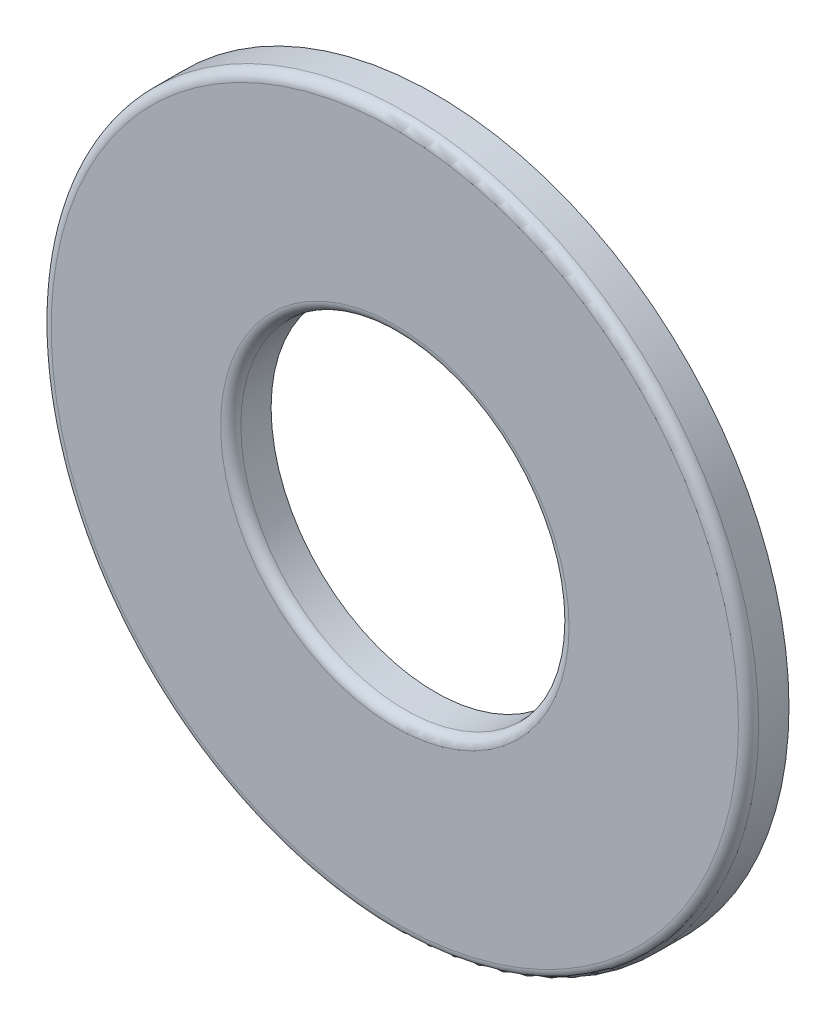
ISO-10303-21;
HEADER;
FILE_DESCRIPTION(('STEP AP214'),'2;1');
FILE_NAME('part.step','',(''),(''),'','','');
FILE_SCHEMA(('AUTOMOTIVE_DESIGN { 1 0 10303 214 1 1 1 1 }'));
ENDSEC;
DATA;
#1=APPLICATION_CONTEXT('core data for automotive mechanical design processes');
#2=APPLICATION_PROTOCOL_DEFINITION('international standard','automotive_design',2000,#1);
#3=PRODUCT_CONTEXT('',#1,'mechanical');
#4=PRODUCT('Part','Part','',(#3));
#5=PRODUCT_RELATED_PRODUCT_CATEGORY('part','',(#4));
#6=PRODUCT_DEFINITION_FORMATION('','',#4);
#7=PRODUCT_DEFINITION_CONTEXT('part definition',#1,'design');
#8=PRODUCT_DEFINITION('design','',#6,#7);
#9=PRODUCT_DEFINITION_SHAPE('','',#8);
#10=(LENGTH_UNIT() NAMED_UNIT(*) SI_UNIT(.MILLI.,.METRE.));
#11=(NAMED_UNIT(*) PLANE_ANGLE_UNIT() SI_UNIT($,.RADIAN.));
#12=(NAMED_UNIT(*) SI_UNIT($,.STERADIAN.) SOLID_ANGLE_UNIT());
#13=UNCERTAINTY_MEASURE_WITH_UNIT(LENGTH_MEASURE(1.E-05),#10,'distance_accuracy_value','');
#14=(GEOMETRIC_REPRESENTATION_CONTEXT(3) GLOBAL_UNCERTAINTY_ASSIGNED_CONTEXT((#13)) GLOBAL_UNIT_ASSIGNED_CONTEXT((#10,
#11,#12)) REPRESENTATION_CONTEXT('',''));
#15=CARTESIAN_POINT('',(0.,0.,0.));
#16=DIRECTION('',(0.,0.,1.));
#17=DIRECTION('',(1.,0.,0.));
#18=AXIS2_PLACEMENT_3D('',#15,#16,#17);
#19=CARTESIAN_POINT('',(0.,0.,0.634999999999998));
#20=DIRECTION('',(0.,0.,1.));
#21=DIRECTION('',(1.,0.,0.));
#22=AXIS2_PLACEMENT_3D('',#19,#20,#21);
#23=PLANE('',#22);
#24=CARTESIAN_POINT('',(0.,0.,0.634999999999998));
#25=DIRECTION('',(0.,0.,1.));
#26=DIRECTION('',(1.,0.,0.));
#27=AXIS2_PLACEMENT_3D('',#24,#25,#26);
#28=CIRCLE('',#27,10.795);
#29=CARTESIAN_POINT('',(10.795,0.,0.634999999999998));
#30=VERTEX_POINT('',#29);
#31=EDGE_CURVE('E50',#30,#30,#28,.T.);
#32=ORIENTED_EDGE('',*,*,#31,.T.);
#33=EDGE_LOOP('',(#32));
#34=FACE_BOUND('',#33,.T.);
#35=CARTESIAN_POINT('',(0.,0.,0.634999999999998));
#36=DIRECTION('',(0.,0.,1.));
#37=DIRECTION('',(1.,0.,0.));
#38=AXIS2_PLACEMENT_3D('',#35,#36,#37);
#39=CIRCLE('',#38,5.4737);
#40=CARTESIAN_POINT('',(5.4737,0.,0.634999999999998));
#41=VERTEX_POINT('',#40);
#42=EDGE_CURVE('E54',#41,#41,#39,.F.);
#43=ORIENTED_EDGE('',*,*,#42,.T.);
#44=EDGE_LOOP('',(#43));
#45=FACE_BOUND('',#44,.T.);
#46=ADVANCED_FACE('F39',(#34,#45),#23,.T.);
#47=CARTESIAN_POINT('',(0.,0.,0.634999999999998));
#48=DIRECTION('',(0.,0.,-1.));
#49=DIRECTION('',(-1.,0.,0.));
#50=AXIS2_PLACEMENT_3D('',#47,#48,#49);
#51=CYLINDRICAL_SURFACE('',#50,11.1125);
#52=CARTESIAN_POINT('',(0.,0.,0.317499999999998));
#53=DIRECTION('',(0.,0.,1.));
#54=DIRECTION('',(1.,0.,0.));
#55=AXIS2_PLACEMENT_3D('',#52,#53,#54);
#56=CIRCLE('',#55,11.1125);
#57=CARTESIAN_POINT('',(11.1125,0.,0.317499999999998));
#58=VERTEX_POINT('',#57);
#59=EDGE_CURVE('E46',#58,#58,#56,.F.);
#60=ORIENTED_EDGE('',*,*,#59,.T.);
#61=EDGE_LOOP('',(#60));
#62=FACE_BOUND('',#61,.T.);
#63=CARTESIAN_POINT('',(0.,0.,-0.635000000000002));
#64=DIRECTION('',(0.,0.,1.));
#65=DIRECTION('',(1.,0.,0.));
#66=AXIS2_PLACEMENT_3D('',#63,#64,#65);
#67=CIRCLE('',#66,11.1125);
#68=CARTESIAN_POINT('',(11.1125,0.,-0.635000000000002));
#69=VERTEX_POINT('',#68);
#70=EDGE_CURVE('E59',#69,#69,#67,.T.);
#71=ORIENTED_EDGE('',*,*,#70,.T.);
#72=EDGE_LOOP('',(#71));
#73=FACE_BOUND('',#72,.T.);
#74=ADVANCED_FACE('F71',(#62,#73),#51,.T.);
#75=CARTESIAN_POINT('',(0.,0.,0.634999999999998));
#76=DIRECTION('',(0.,0.,-1.));
#77=DIRECTION('',(-1.,0.,0.));
#78=AXIS2_PLACEMENT_3D('',#75,#76,#77);
#79=CYLINDRICAL_SURFACE('',#78,5.1562);
#80=CARTESIAN_POINT('',(0.,0.,0.317499999999998));
#81=DIRECTION('',(0.,0.,1.));
#82=DIRECTION('',(1.,0.,0.));
#83=AXIS2_PLACEMENT_3D('',#80,#81,#82);
#84=CIRCLE('',#83,5.1562);
#85=CARTESIAN_POINT('',(5.1562,0.,0.317499999999998));
#86=VERTEX_POINT('',#85);
#87=EDGE_CURVE('E10',#86,#86,#84,.T.);
#88=ORIENTED_EDGE('',*,*,#87,.T.);
#89=EDGE_LOOP('',(#88));
#90=FACE_BOUND('',#89,.T.);
#91=CARTESIAN_POINT('',(0.,0.,-0.635000000000002));
#92=DIRECTION('',(0.,0.,1.));
#93=DIRECTION('',(1.,0.,0.));
#94=AXIS2_PLACEMENT_3D('',#91,#92,#93);
#95=CIRCLE('',#94,5.1562);
#96=CARTESIAN_POINT('',(5.1562,0.,-0.635000000000002));
#97=VERTEX_POINT('',#96);
#98=EDGE_CURVE('E62',#97,#97,#95,.T.);
#99=ORIENTED_EDGE('',*,*,#98,.F.);
#100=EDGE_LOOP('',(#99));
#101=FACE_BOUND('',#100,.T.);
#102=ADVANCED_FACE('F69',(#90,#101),#79,.F.);
#103=CARTESIAN_POINT('',(0.,0.,-0.635000000000002));
#104=DIRECTION('',(0.,0.,1.));
#105=DIRECTION('',(1.,0.,0.));
#106=AXIS2_PLACEMENT_3D('',#103,#104,#105);
#107=PLANE('',#106);
#108=ORIENTED_EDGE('',*,*,#98,.T.);
#109=EDGE_LOOP('',(#108));
#110=FACE_BOUND('',#109,.T.);
#111=ORIENTED_EDGE('',*,*,#70,.F.);
#112=EDGE_LOOP('',(#111));
#113=FACE_BOUND('',#112,.T.);
#114=ADVANCED_FACE('F66',(#110,#113),#107,.F.);
#115=CARTESIAN_POINT('',(0.,0.,0.317499999999998));
#116=DIRECTION('',(0.,0.,1.));
#117=DIRECTION('',(1.,0.,0.));
#118=AXIS2_PLACEMENT_3D('',#115,#116,#117);
#119=TOROIDAL_SURFACE('',#118,10.795,0.3175);
#120=ORIENTED_EDGE('',*,*,#59,.F.);
#121=EDGE_LOOP('',(#120));
#122=FACE_BOUND('',#121,.T.);
#123=ORIENTED_EDGE('',*,*,#31,.F.);
#124=EDGE_LOOP('',(#123));
#125=FACE_BOUND('',#124,.T.);
#126=ADVANCED_FACE('F78',(#122,#125),#119,.T.);
#127=CARTESIAN_POINT('',(0.,0.,0.317499999999998));
#128=DIRECTION('',(0.,0.,1.));
#129=DIRECTION('',(1.,0.,0.));
#130=AXIS2_PLACEMENT_3D('',#127,#128,#129);
#131=TOROIDAL_SURFACE('',#130,5.4737,0.3175);
#132=ORIENTED_EDGE('',*,*,#42,.F.);
#133=EDGE_LOOP('',(#132));
#134=FACE_BOUND('',#133,.T.);
#135=ORIENTED_EDGE('',*,*,#87,.F.);
#136=EDGE_LOOP('',(#135));
#137=FACE_BOUND('',#136,.T.);
#138=ADVANCED_FACE('F41',(#134,#137),#131,.T.);
#139=CLOSED_SHELL('',(#46,#74,#102,#114,#126,#138));
#140=MANIFOLD_SOLID_BREP('B2',#139);
#141=ADVANCED_BREP_SHAPE_REPRESENTATION('',(#18,#140),#14);
#142=SHAPE_DEFINITION_REPRESENTATION(#9,#141);
ENDSEC;
END-ISO-10303-21;
